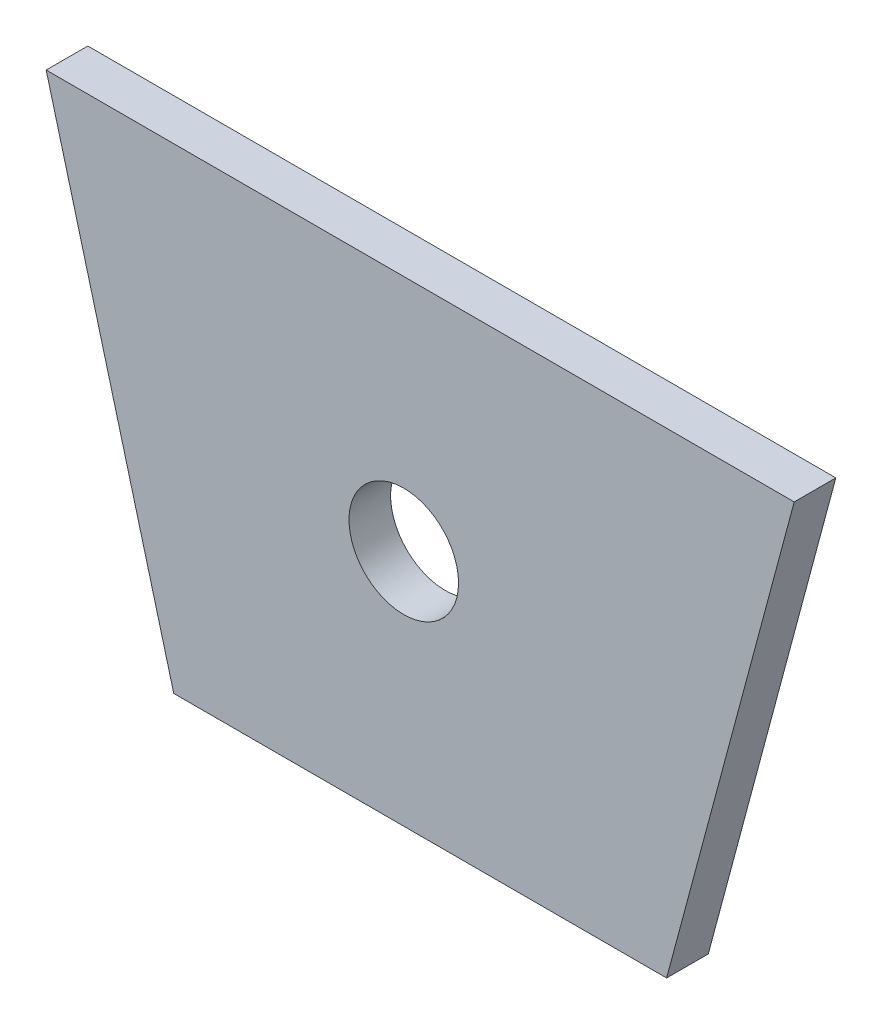
ISO-10303-21;
HEADER;
FILE_DESCRIPTION(('STEP AP214'),'2;1');
FILE_NAME('part.step','',(''),(''),'','','');
FILE_SCHEMA(('AUTOMOTIVE_DESIGN { 1 0 10303 214 1 1 1 1 }'));
ENDSEC;
DATA;
#1=APPLICATION_CONTEXT('core data for automotive mechanical design processes');
#2=APPLICATION_PROTOCOL_DEFINITION('international standard','automotive_design',2000,#1);
#3=PRODUCT_CONTEXT('',#1,'mechanical');
#4=PRODUCT('Part','Part','',(#3));
#5=PRODUCT_RELATED_PRODUCT_CATEGORY('part','',(#4));
#6=PRODUCT_DEFINITION_FORMATION('','',#4);
#7=PRODUCT_DEFINITION_CONTEXT('part definition',#1,'design');
#8=PRODUCT_DEFINITION('design','',#6,#7);
#9=PRODUCT_DEFINITION_SHAPE('','',#8);
#10=(LENGTH_UNIT() NAMED_UNIT(*) SI_UNIT(.MILLI.,.METRE.));
#11=(NAMED_UNIT(*) PLANE_ANGLE_UNIT() SI_UNIT($,.RADIAN.));
#12=(NAMED_UNIT(*) SI_UNIT($,.STERADIAN.) SOLID_ANGLE_UNIT());
#13=UNCERTAINTY_MEASURE_WITH_UNIT(LENGTH_MEASURE(1.E-05),#10,'distance_accuracy_value','');
#14=(GEOMETRIC_REPRESENTATION_CONTEXT(3) GLOBAL_UNCERTAINTY_ASSIGNED_CONTEXT((#13)) GLOBAL_UNIT_ASSIGNED_CONTEXT((#10,
#11,#12)) REPRESENTATION_CONTEXT('',''));
#15=CARTESIAN_POINT('',(0.,0.,0.));
#16=DIRECTION('',(0.,0.,1.));
#17=DIRECTION('',(1.,0.,0.));
#18=AXIS2_PLACEMENT_3D('',#15,#16,#17);
#19=CARTESIAN_POINT('',(-26.6699999999999,-22.2117967201578,4.826));
#20=DIRECTION('',(0.965925826289068,0.258819045102522,0.));
#21=DIRECTION('',(-0.258819045102522,0.965925826289068,0.));
#22=AXIS2_PLACEMENT_3D('',#19,#20,#21);
#23=PLANE('',#22);
#24=DIRECTION('',(0.258819045102522,-0.965925826289068,0.));
#25=VECTOR('',#24,1.);
#26=CARTESIAN_POINT('',(-26.6699999999999,-22.2117967201578,0.));
#27=LINE('',#26,#25);
#28=CARTESIAN_POINT('',(-41.461508427609,32.9908642522625,0.));
#29=VERTEX_POINT('',#28);
#30=CARTESIAN_POINT('',(-26.6699999999999,-22.2117967201578,0.));
#31=VERTEX_POINT('',#30);
#32=EDGE_CURVE('E97',#29,#31,#27,.T.);
#33=ORIENTED_EDGE('',*,*,#32,.T.);
#34=DIRECTION('',(0.,0.,-1.));
#35=VECTOR('',#34,1.);
#36=CARTESIAN_POINT('',(-26.6699999999999,-22.2117967201578,4.826));
#37=LINE('',#36,#35);
#38=CARTESIAN_POINT('',(-26.6699999999999,-22.2117967201578,4.826));
#39=VERTEX_POINT('',#38);
#40=EDGE_CURVE('E11',#39,#31,#37,.T.);
#41=ORIENTED_EDGE('',*,*,#40,.F.);
#42=DIRECTION('',(0.258819045102522,-0.965925826289068,0.));
#43=VECTOR('',#42,1.);
#44=CARTESIAN_POINT('',(-26.6699999999999,-22.2117967201578,4.826));
#45=LINE('',#44,#43);
#46=CARTESIAN_POINT('',(-41.461508427609,32.9908642522625,4.826));
#47=VERTEX_POINT('',#46);
#48=EDGE_CURVE('E85',#47,#39,#45,.T.);
#49=ORIENTED_EDGE('',*,*,#48,.F.);
#50=DIRECTION('',(0.,0.,-1.));
#51=VECTOR('',#50,1.);
#52=CARTESIAN_POINT('',(-41.461508427609,32.9908642522625,4.826));
#53=LINE('',#52,#51);
#54=EDGE_CURVE('E93',#47,#29,#53,.T.);
#55=ORIENTED_EDGE('',*,*,#54,.T.);
#56=EDGE_LOOP('',(#33,#41,#49,#55));
#57=FACE_BOUND('',#56,.T.);
#58=ADVANCED_FACE('F34',(#57),#23,.F.);
#59=CARTESIAN_POINT('',(-26.6699999999999,-22.2117967201578,4.826));
#60=DIRECTION('',(0.,1.,0.));
#61=DIRECTION('',(0.,0.,1.));
#62=AXIS2_PLACEMENT_3D('',#59,#60,#61);
#63=PLANE('',#62);
#64=DIRECTION('',(1.,0.,0.));
#65=VECTOR('',#64,1.);
#66=CARTESIAN_POINT('',(-26.6699999999999,-22.2117967201578,0.));
#67=LINE('',#66,#65);
#68=CARTESIAN_POINT('',(30.4800000000001,-22.2117967201578,0.));
#69=VERTEX_POINT('',#68);
#70=EDGE_CURVE('E89',#31,#69,#67,.T.);
#71=ORIENTED_EDGE('',*,*,#70,.T.);
#72=DIRECTION('',(0.,0.,-1.));
#73=VECTOR('',#72,1.);
#74=CARTESIAN_POINT('',(30.4800000000001,-22.2117967201578,4.826));
#75=LINE('',#74,#73);
#76=CARTESIAN_POINT('',(30.4800000000001,-22.2117967201578,4.826));
#77=VERTEX_POINT('',#76);
#78=EDGE_CURVE('E42',#77,#69,#75,.T.);
#79=ORIENTED_EDGE('',*,*,#78,.F.);
#80=DIRECTION('',(1.,0.,0.));
#81=VECTOR('',#80,1.);
#82=CARTESIAN_POINT('',(-26.6699999999999,-22.2117967201578,4.826));
#83=LINE('',#82,#81);
#84=EDGE_CURVE('E80',#39,#77,#83,.T.);
#85=ORIENTED_EDGE('',*,*,#84,.F.);
#86=ORIENTED_EDGE('',*,*,#40,.T.);
#87=EDGE_LOOP('',(#71,#79,#85,#86));
#88=FACE_BOUND('',#87,.T.);
#89=ADVANCED_FACE('F88',(#88),#63,.F.);
#90=CARTESIAN_POINT('',(45.2715084276087,32.9908642522625,4.826));
#91=DIRECTION('',(-0.96592582628907,0.258819045102513,0.));
#92=DIRECTION('',(-0.258819045102513,-0.96592582628907,0.));
#93=AXIS2_PLACEMENT_3D('',#90,#91,#92);
#94=PLANE('',#93);
#95=DIRECTION('',(0.258819045102513,0.96592582628907,0.));
#96=VECTOR('',#95,1.);
#97=CARTESIAN_POINT('',(45.2715084276087,32.9908642522625,0.));
#98=LINE('',#97,#96);
#99=CARTESIAN_POINT('',(45.2715084276087,32.9908642522625,0.));
#100=VERTEX_POINT('',#99);
#101=EDGE_CURVE('E67',#69,#100,#98,.T.);
#102=ORIENTED_EDGE('',*,*,#101,.T.);
#103=DIRECTION('',(0.,0.,-1.));
#104=VECTOR('',#103,1.);
#105=CARTESIAN_POINT('',(45.2715084276087,32.9908642522625,4.826));
#106=LINE('',#105,#104);
#107=CARTESIAN_POINT('',(45.2715084276087,32.9908642522625,4.826));
#108=VERTEX_POINT('',#107);
#109=EDGE_CURVE('E90',#108,#100,#106,.T.);
#110=ORIENTED_EDGE('',*,*,#109,.F.);
#111=DIRECTION('',(0.258819045102513,0.96592582628907,0.));
#112=VECTOR('',#111,1.);
#113=CARTESIAN_POINT('',(45.2715084276087,32.9908642522625,4.826));
#114=LINE('',#113,#112);
#115=EDGE_CURVE('E83',#77,#108,#114,.T.);
#116=ORIENTED_EDGE('',*,*,#115,.F.);
#117=ORIENTED_EDGE('',*,*,#78,.T.);
#118=EDGE_LOOP('',(#102,#110,#116,#117));
#119=FACE_BOUND('',#118,.T.);
#120=ADVANCED_FACE('F91',(#119),#94,.F.);
#121=CARTESIAN_POINT('',(-41.461508427609,32.9908642522625,4.826));
#122=DIRECTION('',(0.,-1.,0.));
#123=DIRECTION('',(0.,0.,-1.));
#124=AXIS2_PLACEMENT_3D('',#121,#122,#123);
#125=PLANE('',#124);
#126=DIRECTION('',(-1.,0.,0.));
#127=VECTOR('',#126,1.);
#128=CARTESIAN_POINT('',(-41.461508427609,32.9908642522625,0.));
#129=LINE('',#128,#127);
#130=EDGE_CURVE('E73',#100,#29,#129,.T.);
#131=ORIENTED_EDGE('',*,*,#130,.T.);
#132=ORIENTED_EDGE('',*,*,#54,.F.);
#133=DIRECTION('',(-1.,0.,0.));
#134=VECTOR('',#133,1.);
#135=CARTESIAN_POINT('',(-41.461508427609,32.9908642522625,4.826));
#136=LINE('',#135,#134);
#137=EDGE_CURVE('E50',#108,#47,#136,.T.);
#138=ORIENTED_EDGE('',*,*,#137,.F.);
#139=ORIENTED_EDGE('',*,*,#109,.T.);
#140=EDGE_LOOP('',(#131,#132,#138,#139));
#141=FACE_BOUND('',#140,.T.);
#142=ADVANCED_FACE('F105',(#141),#125,.F.);
#143=CARTESIAN_POINT('',(0.,0.,4.826));
#144=DIRECTION('',(0.,0.,-1.));
#145=DIRECTION('',(-1.,0.,0.));
#146=AXIS2_PLACEMENT_3D('',#143,#144,#145);
#147=PLANE('',#146);
#148=CARTESIAN_POINT('',(0.,5.38953376605234,4.826));
#149=DIRECTION('',(0.,0.,1.));
#150=DIRECTION('',(1.,0.,0.));
#151=AXIS2_PLACEMENT_3D('',#148,#149,#150);
#152=CIRCLE('',#151,6.35);
#153=CARTESIAN_POINT('',(6.35,5.38953376605234,4.826));
#154=VERTEX_POINT('',#153);
#155=EDGE_CURVE('E100',#154,#154,#152,.T.);
#156=ORIENTED_EDGE('',*,*,#155,.F.);
#157=EDGE_LOOP('',(#156));
#158=FACE_BOUND('',#157,.T.);
#159=ORIENTED_EDGE('',*,*,#48,.T.);
#160=ORIENTED_EDGE('',*,*,#84,.T.);
#161=ORIENTED_EDGE('',*,*,#115,.T.);
#162=ORIENTED_EDGE('',*,*,#137,.T.);
#163=EDGE_LOOP('',(#159,#160,#161,#162));
#164=FACE_BOUND('',#163,.T.);
#165=ADVANCED_FACE('F81',(#158,#164),#147,.F.);
#166=CARTESIAN_POINT('',(0.,0.,0.));
#167=DIRECTION('',(0.,0.,-1.));
#168=DIRECTION('',(-1.,0.,0.));
#169=AXIS2_PLACEMENT_3D('',#166,#167,#168);
#170=PLANE('',#169);
#171=CARTESIAN_POINT('',(0.,5.38953376605234,0.));
#172=DIRECTION('',(0.,0.,1.));
#173=DIRECTION('',(1.,0.,0.));
#174=AXIS2_PLACEMENT_3D('',#171,#172,#173);
#175=CIRCLE('',#174,6.35);
#176=CARTESIAN_POINT('',(6.35,5.38953376605234,0.));
#177=VERTEX_POINT('',#176);
#178=EDGE_CURVE('E111',#177,#177,#175,.T.);
#179=ORIENTED_EDGE('',*,*,#178,.T.);
#180=EDGE_LOOP('',(#179));
#181=FACE_BOUND('',#180,.T.);
#182=ORIENTED_EDGE('',*,*,#32,.F.);
#183=ORIENTED_EDGE('',*,*,#130,.F.);
#184=ORIENTED_EDGE('',*,*,#101,.F.);
#185=ORIENTED_EDGE('',*,*,#70,.F.);
#186=EDGE_LOOP('',(#182,#183,#184,#185));
#187=FACE_BOUND('',#186,.T.);
#188=ADVANCED_FACE('F108',(#181,#187),#170,.T.);
#189=CARTESIAN_POINT('',(0.,5.38953376605234,4.826));
#190=DIRECTION('',(0.,0.,-1.));
#191=DIRECTION('',(-1.,0.,0.));
#192=AXIS2_PLACEMENT_3D('',#189,#190,#191);
#193=CYLINDRICAL_SURFACE('',#192,6.35);
#194=ORIENTED_EDGE('',*,*,#155,.T.);
#195=EDGE_LOOP('',(#194));
#196=FACE_BOUND('',#195,.T.);
#197=ORIENTED_EDGE('',*,*,#178,.F.);
#198=EDGE_LOOP('',(#197));
#199=FACE_BOUND('',#198,.T.);
#200=ADVANCED_FACE('F117',(#196,#199),#193,.F.);
#201=CLOSED_SHELL('',(#58,#89,#120,#142,#165,#188,#200));
#202=MANIFOLD_SOLID_BREP('B2',#201);
#203=ADVANCED_BREP_SHAPE_REPRESENTATION('',(#18,#202),#14);
#204=SHAPE_DEFINITION_REPRESENTATION(#9,#203);
ENDSEC;
END-ISO-10303-21;
